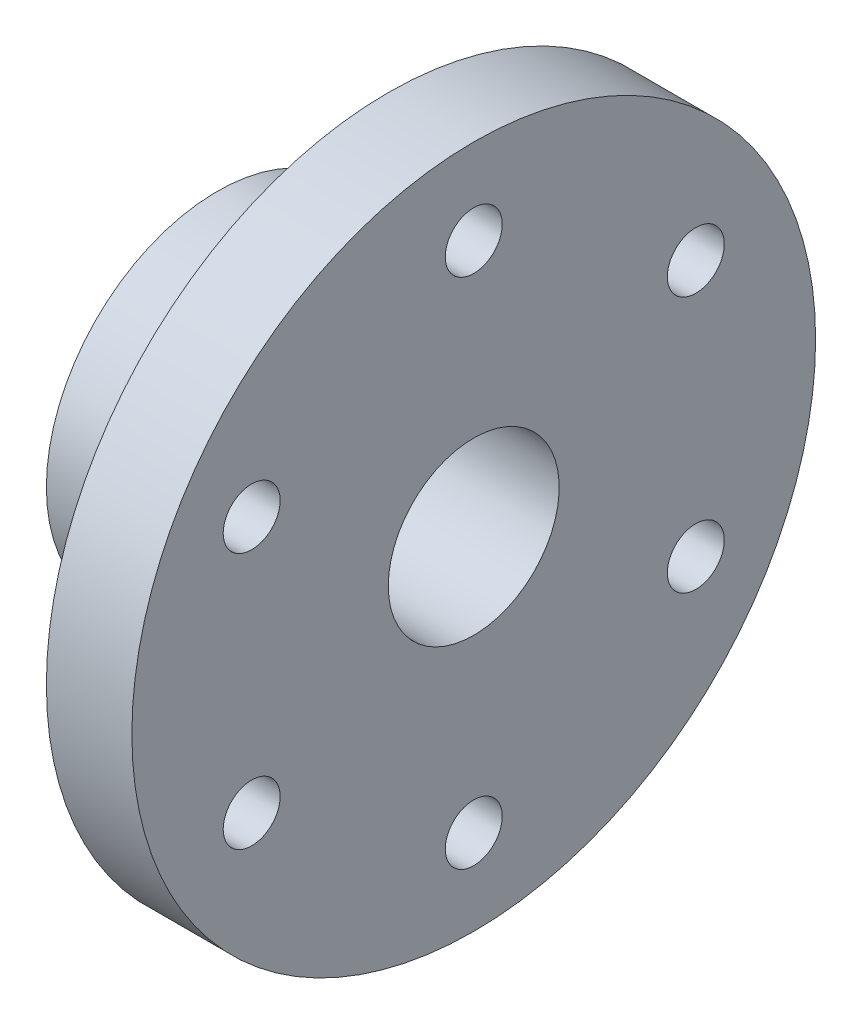
ISO-10303-21;
HEADER;
FILE_DESCRIPTION(('STEP AP214'),'2;1');
FILE_NAME('part.step','',(''),(''),'','','');
FILE_SCHEMA(('AUTOMOTIVE_DESIGN { 1 0 10303 214 1 1 1 1 }'));
ENDSEC;
DATA;
#1=APPLICATION_CONTEXT('core data for automotive mechanical design processes');
#2=APPLICATION_PROTOCOL_DEFINITION('international standard','automotive_design',2000,#1);
#3=PRODUCT_CONTEXT('',#1,'mechanical');
#4=PRODUCT('Part','Part','',(#3));
#5=PRODUCT_RELATED_PRODUCT_CATEGORY('part','',(#4));
#6=PRODUCT_DEFINITION_FORMATION('','',#4);
#7=PRODUCT_DEFINITION_CONTEXT('part definition',#1,'design');
#8=PRODUCT_DEFINITION('design','',#6,#7);
#9=PRODUCT_DEFINITION_SHAPE('','',#8);
#10=(LENGTH_UNIT() NAMED_UNIT(*) SI_UNIT(.MILLI.,.METRE.));
#11=(NAMED_UNIT(*) PLANE_ANGLE_UNIT() SI_UNIT($,.RADIAN.));
#12=(NAMED_UNIT(*) SI_UNIT($,.STERADIAN.) SOLID_ANGLE_UNIT());
#13=UNCERTAINTY_MEASURE_WITH_UNIT(LENGTH_MEASURE(1.E-05),#10,'distance_accuracy_value','');
#14=(GEOMETRIC_REPRESENTATION_CONTEXT(3) GLOBAL_UNCERTAINTY_ASSIGNED_CONTEXT((#13)) GLOBAL_UNIT_ASSIGNED_CONTEXT((#10,
#11,#12)) REPRESENTATION_CONTEXT('',''));
#15=CARTESIAN_POINT('',(0.,0.,0.));
#16=DIRECTION('',(0.,0.,1.));
#17=DIRECTION('',(1.,0.,0.));
#18=AXIS2_PLACEMENT_3D('',#15,#16,#17);
#19=CARTESIAN_POINT('',(-11.6129032258065,0.,0.));
#20=DIRECTION('',(-1.,0.,0.));
#21=DIRECTION('',(0.,0.,1.));
#22=AXIS2_PLACEMENT_3D('',#19,#20,#21);
#23=CYLINDRICAL_SURFACE('',#22,24.);
#24=CARTESIAN_POINT('',(-9.70046082949309,0.,24.));
#25=CARTESIAN_POINT('',(-9.7004697718096,-0.223025447933144,23.9999961787012));
#26=CARTESIAN_POINT('',(-9.71917646944337,-0.446172610942113,23.9968588466085));
#27=CARTESIAN_POINT('',(-9.79347788351762,-0.886208354676868,23.9846455190622));
#28=CARTESIAN_POINT('',(-9.84910652055166,-1.1030909887348,23.9755640627822));
#29=CARTESIAN_POINT('',(-9.9955255472415,-1.52416759554023,23.9524810917832));
#30=CARTESIAN_POINT('',(-10.086287174518,-1.72837178949104,23.9384836025471));
#31=CARTESIAN_POINT('',(-10.3003204967769,-2.11862694716471,23.9071076333131));
#32=CARTESIAN_POINT('',(-10.4235884734659,-2.30467998380575,23.8897295400709));
#33=CARTESIAN_POINT('',(-10.7003889636058,-2.65515618286669,23.853333079333));
#34=CARTESIAN_POINT('',(-10.8541714129109,-2.81938064565595,23.8343019490377));
#35=CARTESIAN_POINT('',(-11.1870975790496,-3.11982159785588,23.7968420300277));
#36=CARTESIAN_POINT('',(-11.3662428958237,-3.25603631902555,23.7784132794027));
#37=CARTESIAN_POINT('',(-11.7461743754084,-3.49738740096821,23.7441210521565));
#38=CARTESIAN_POINT('',(-11.9470869683807,-3.6023272845776,23.7282740654662));
#39=CARTESIAN_POINT('',(-12.3639961323741,-3.77689338465795,23.7011166367148));
#40=CARTESIAN_POINT('',(-12.5799916833773,-3.84652198650498,23.6898058882289));
#41=CARTESIAN_POINT('',(-13.0188292692636,-3.94786300445569,23.6731285894841));
#42=CARTESIAN_POINT('',(-13.2415900078953,-3.97991844661664,23.6677082957712));
#43=CARTESIAN_POINT('',(-13.6893892725066,-4.0062667604638,23.6632630229864));
#44=CARTESIAN_POINT('',(-13.9144276361608,-4.0005623046224,23.6642375913154));
#45=CARTESIAN_POINT('',(-14.3579454075338,-3.95183215743384,23.6724228618169));
#46=CARTESIAN_POINT('',(-14.5764685151655,-3.90919181102364,23.6795691731027));
#47=CARTESIAN_POINT('',(-15.0032149380197,-3.78840502464551,23.6991919233761));
#48=CARTESIAN_POINT('',(-15.2114378997148,-3.71025736691159,23.7116685451723));
#49=CARTESIAN_POINT('',(-15.6128269469986,-3.52028359375026,23.7406156693456));
#50=CARTESIAN_POINT('',(-15.8059158792231,-3.40829746220754,23.7571050737172));
#51=CARTESIAN_POINT('',(-16.1707078703545,-3.1539392280919,23.7922066946401));
#52=CARTESIAN_POINT('',(-16.342409201421,-3.01156467304686,23.8108190824686));
#53=CARTESIAN_POINT('',(-16.6617825667848,-2.69837153945449,23.8483524460766));
#54=CARTESIAN_POINT('',(-16.8091304591572,-2.527222342197,23.8672743877064));
#55=CARTESIAN_POINT('',(-17.0730652497576,-2.16245639837063,23.9030816223476));
#56=CARTESIAN_POINT('',(-17.1896519497863,-1.96883950705028,23.9199669022359));
#57=CARTESIAN_POINT('',(-17.3887843929111,-1.56432946586674,23.9498222862866));
#58=CARTESIAN_POINT('',(-17.4713015004231,-1.35342196090346,23.9627890945191));
#59=CARTESIAN_POINT('',(-17.5996515738867,-0.92047735296437,23.9833200482025));
#60=CARTESIAN_POINT('',(-17.645487608651,-0.69844118268715,23.9908846456076));
#61=CARTESIAN_POINT('',(-17.6987350030309,-0.252335842082599,23.999698077483));
#62=CARTESIAN_POINT('',(-17.7065913443821,-0.028321179441619,24.0010200482045));
#63=CARTESIAN_POINT('',(-17.6848426784081,0.417823636623819,23.9973995907387));
#64=CARTESIAN_POINT('',(-17.6552391124791,0.639953862227262,23.9924574035859));
#65=CARTESIAN_POINT('',(-17.5597810705563,1.07464988087482,23.9769092310112));
#66=CARTESIAN_POINT('',(-17.4941468960689,1.28726538941661,23.966337676821));
#67=CARTESIAN_POINT('',(-17.3287256003738,1.69847501577671,23.9407114312857));
#68=CARTESIAN_POINT('',(-17.2289365612767,1.89706834545555,23.9256564881923));
#69=CARTESIAN_POINT('',(-16.9970190299782,2.27652910315033,23.8925522608385));
#70=CARTESIAN_POINT('',(-16.8646125796255,2.45722440149944,23.8744776941924));
#71=CARTESIAN_POINT('',(-16.571601124877,2.7939897368043,23.8374154782704));
#72=CARTESIAN_POINT('',(-16.4109940722504,2.95005798351453,23.8184277627447));
#73=CARTESIAN_POINT('',(-16.0641447525788,3.2347884474528,23.7814428037735));
#74=CARTESIAN_POINT('',(-15.87765416467,3.36315001778194,23.7634578581937));
#75=CARTESIAN_POINT('',(-15.4854960788714,3.58672369647198,23.7307444764461));
#76=CARTESIAN_POINT('',(-15.2798291891291,3.68193685563172,23.7160159370563));
#77=CARTESIAN_POINT('',(-14.8559972569937,3.83606133035704,23.6915752591633));
#78=CARTESIAN_POINT('',(-14.6378878774443,3.89512229207671,23.681842468977));
#79=CARTESIAN_POINT('',(-14.1946686227383,3.97573672604524,23.6684434693642));
#80=CARTESIAN_POINT('',(-13.9695593579218,3.99729345911387,23.6647767325235));
#81=CARTESIAN_POINT('',(-13.5217325639532,4.00219658567577,23.6639477293442));
#82=CARTESIAN_POINT('',(-13.2990202237726,3.9860162178003,23.6667049040904));
#83=CARTESIAN_POINT('',(-12.8595340326119,3.91692774233096,23.6782365032596));
#84=CARTESIAN_POINT('',(-12.6427601623861,3.86401975377996,23.6870109081794));
#85=CARTESIAN_POINT('',(-12.2214873298249,3.72315918335184,23.7095577005075));
#86=CARTESIAN_POINT('',(-12.0169744134035,3.63524734496071,23.7233242755147));
#87=CARTESIAN_POINT('',(-11.6255237587813,3.42692320626545,23.7543099027553));
#88=CARTESIAN_POINT('',(-11.4385868928977,3.3065092939977,23.7715291262144));
#89=CARTESIAN_POINT('',(-11.0852038965207,3.03491021499545,23.8077352647299));
#90=CARTESIAN_POINT('',(-10.9190272027727,2.88337690174984,23.8267407292208));
#91=CARTESIAN_POINT('',(-10.6142982623332,2.55457445020837,23.8642299577735));
#92=CARTESIAN_POINT('',(-10.475752399672,2.37729938066022,23.8827136004247));
#93=CARTESIAN_POINT('',(-10.2293436003732,2.00059067142445,23.9172244742755));
#94=CARTESIAN_POINT('',(-10.1216991665924,1.80101246005251,23.9332338600497));
#95=CARTESIAN_POINT('',(-9.94162965411722,1.38642091100637,23.9608186816284));
#96=CARTESIAN_POINT('',(-9.86916949976558,1.17142319172802,23.9723985308397));
#97=CARTESIAN_POINT('',(-9.77725239089043,0.796325296072642,23.9872926533273));
#98=CARTESIAN_POINT('',(-9.74850167810755,0.638494128477517,23.9920324363737));
#99=CARTESIAN_POINT('',(-9.71010284894149,0.320462896511695,23.9983874557779));
#100=CARTESIAN_POINT('',(-9.70045440367331,0.160262872973591,24.0000027459303));
#101=CARTESIAN_POINT('',(-9.70046082949309,0.,24.));
#102=B_SPLINE_CURVE_WITH_KNOTS('',3,(#24,#25,#26,#27,#28,#29,#30,#31,#32,#33,#34,#35,#36,#37,
#38,#39,#40,#41,#42,#43,#44,#45,#46,#47,#48,#49,#50,#51,#52,#53,#54,#55,#56,#57,#58,#59,#60,#61,
#62,#63,#64,#65,#66,#67,#68,#69,#70,#71,#72,#73,#74,#75,#76,#77,#78,#79,#80,#81,#82,#83,#84,#85,
#86,#87,#88,#89,#90,#91,#92,#93,#94,#95,#96,#97,#98,#99,#100,#101),.UNSPECIFIED.,.T.,.F.,(4,2,2,
2,2,2,2,2,2,2,2,2,2,2,2,2,2,2,2,2,2,2,2,2,2,2,2,2,2,2,2,2,2,2,2,2,2,2,4),(0.,0.668490535901615,
1.33759607311267,2.00615498724043,2.67463746027966,3.34883985699731,4.02308480271771,
4.70148033318144,5.3798300300189,6.05193723365478,6.72399686913418,7.38912834816654,
8.0542826404061,8.72263290612092,9.39103713088918,10.0677243185812,10.7444158661736,
11.4216750226545,12.0988775123384,12.7681261358624,13.4373490085738,14.1025249121026,
14.7677381732171,15.4388292100324,16.1099690088685,16.7880611521219,17.4661317980151,
18.1413763574684,18.8165622045859,19.4833265523632,20.1500887390101,20.8160770916196,
21.4820984804694,22.1560221470943,22.8301013420636,23.5088357057152,24.1868920340812,
24.6672679706243,25.1476356364315),.UNSPECIFIED.);
#103=CARTESIAN_POINT('',(-9.70046082949309,0.,24.));
#104=VERTEX_POINT('',#103);
#105=EDGE_CURVE('E91',#104,#104,#102,.T.);
#106=ORIENTED_EDGE('',*,*,#105,.T.);
#107=EDGE_LOOP('',(#106));
#108=FACE_BOUND('',#107,.T.);
#109=CARTESIAN_POINT('',(-25.7004608294931,0.,0.));
#110=DIRECTION('',(-1.,0.,0.));
#111=DIRECTION('',(0.,0.,1.));
#112=AXIS2_PLACEMENT_3D('',#109,#110,#111);
#113=CIRCLE('',#112,24.);
#114=CARTESIAN_POINT('',(-25.7004608294931,0.,24.));
#115=VERTEX_POINT('',#114);
#116=EDGE_CURVE('E10',#115,#115,#113,.T.);
#117=ORIENTED_EDGE('',*,*,#116,.F.);
#118=EDGE_LOOP('',(#117));
#119=FACE_BOUND('',#118,.T.);
#120=CARTESIAN_POINT('',(-1.70046082949309,0.,0.));
#121=DIRECTION('',(-1.,0.,0.));
#122=DIRECTION('',(0.,0.,1.));
#123=AXIS2_PLACEMENT_3D('',#120,#121,#122);
#124=CIRCLE('',#123,24.);
#125=CARTESIAN_POINT('',(-1.70046082949309,0.,24.));
#126=VERTEX_POINT('',#125);
#127=EDGE_CURVE('E56',#126,#126,#124,.T.);
#128=ORIENTED_EDGE('',*,*,#127,.T.);
#129=EDGE_LOOP('',(#128));
#130=FACE_BOUND('',#129,.T.);
#131=ADVANCED_FACE('F33',(#108,#119,#130),#23,.T.);
#132=CARTESIAN_POINT('',(-25.7004608294931,12.,0.));
#133=DIRECTION('',(1.,0.,0.));
#134=DIRECTION('',(0.,0.,-1.));
#135=AXIS2_PLACEMENT_3D('',#132,#133,#134);
#136=PLANE('',#135);
#137=CARTESIAN_POINT('',(-25.7004608294931,0.,0.));
#138=DIRECTION('',(-1.,0.,0.));
#139=DIRECTION('',(0.,0.,1.));
#140=AXIS2_PLACEMENT_3D('',#137,#138,#139);
#141=CIRCLE('',#140,12.);
#142=CARTESIAN_POINT('',(-25.7004608294931,0.,12.));
#143=VERTEX_POINT('',#142);
#144=EDGE_CURVE('E40',#143,#143,#141,.T.);
#145=ORIENTED_EDGE('',*,*,#144,.F.);
#146=EDGE_LOOP('',(#145));
#147=FACE_BOUND('',#146,.T.);
#148=ORIENTED_EDGE('',*,*,#116,.T.);
#149=EDGE_LOOP('',(#148));
#150=FACE_BOUND('',#149,.T.);
#151=ADVANCED_FACE('F152',(#147,#150),#136,.F.);
#152=CARTESIAN_POINT('',(-11.6129032258065,0.,0.));
#153=DIRECTION('',(-1.,0.,0.));
#154=DIRECTION('',(0.,0.,1.));
#155=AXIS2_PLACEMENT_3D('',#152,#153,#154);
#156=CYLINDRICAL_SURFACE('',#155,12.);
#157=CARTESIAN_POINT('',(-9.70046082949309,0.,12.));
#158=CARTESIAN_POINT('',(-9.70045981456653,-0.218253451546893,12.0000006120378));
#159=CARTESIAN_POINT('',(-9.71838189400196,-0.4365007781542,11.9939907803018));
#160=CARTESIAN_POINT('',(-9.78937726476197,-0.866567043491889,11.9706084081312));
#161=CARTESIAN_POINT('',(-9.84245420528878,-1.07838531247527,11.9532346880861));
#162=CARTESIAN_POINT('',(-9.98173780302929,-1.4893311580071,11.9090123162577));
#163=CARTESIAN_POINT('',(-10.0678890793302,-1.68847930354414,11.8821795092341));
#164=CARTESIAN_POINT('',(-10.2706255208465,-2.0694997472213,11.8217778286937));
#165=CARTESIAN_POINT('',(-10.3872166895035,-2.25136862783483,11.7882076267112));
#166=CARTESIAN_POINT('',(-10.6517640489281,-2.59896670008906,11.7165637777201));
#167=CARTESIAN_POINT('',(-10.8005857665351,-2.76401480119322,11.6783822585509));
#168=CARTESIAN_POINT('',(-11.1235294483193,-3.06733077080835,11.6024125913253));
#169=CARTESIAN_POINT('',(-11.297656969207,-3.20559274195791,11.5646245316238));
#170=CARTESIAN_POINT('',(-11.6724012902791,-3.45529976891137,11.492533299089));
#171=CARTESIAN_POINT('',(-11.873635788422,-3.5658594328839,11.4583615710204));
#172=CARTESIAN_POINT('',(-12.2931652073268,-3.75127549551112,11.3990122167512));
#173=CARTESIAN_POINT('',(-12.5114548981424,-3.82614278954793,11.3738318464566));
#174=CARTESIAN_POINT('',(-12.9511537154816,-3.93549384603581,11.3364521307492));
#175=CARTESIAN_POINT('',(-13.1722096634554,-3.97125379308399,11.3238438306895));
#176=CARTESIAN_POINT('',(-13.6175158461106,-4.005364493341,11.3118262652752));
#177=CARTESIAN_POINT('',(-13.8417650723073,-4.0037268064304,11.312412921263));
#178=CARTESIAN_POINT('',(-14.2762073513007,-3.96407961480178,11.3263605999899));
#179=CARTESIAN_POINT('',(-14.4865744412676,-3.92773565262441,11.3391366334693));
#180=CARTESIAN_POINT('',(-14.8980345080139,-3.82242465135522,11.3750663077523));
#181=CARTESIAN_POINT('',(-15.099126371255,-3.75345370635799,11.3982211910317));
#182=CARTESIAN_POINT('',(-15.4901118278288,-3.58375623225407,11.4527164455867));
#183=CARTESIAN_POINT('',(-15.6797729313631,-3.4825361948326,11.4841826318151));
#184=CARTESIAN_POINT('',(-16.0399444626201,-3.25155642520901,11.5517023429386));
#185=CARTESIAN_POINT('',(-16.2104493372288,-3.12178844945505,11.5877571915937));
#186=CARTESIAN_POINT('',(-16.5368272221338,-2.82939733072998,11.6626931667357));
#187=CARTESIAN_POINT('',(-16.6914716075287,-2.66541260030552,11.7016235742007));
#188=CARTESIAN_POINT('',(-16.9713858961473,-2.31335827987998,11.7762775354745));
#189=CARTESIAN_POINT('',(-17.0966529821512,-2.12528638264318,11.8120007815208));
#190=CARTESIAN_POINT('',(-17.3152460304332,-1.72779045218514,11.8766843175136));
#191=CARTESIAN_POINT('',(-17.408242794856,-1.51817310566536,11.9055740003221));
#192=CARTESIAN_POINT('',(-17.557273525316,-1.08507633345801,11.9528226857769));
#193=CARTESIAN_POINT('',(-17.6133203311869,-0.861601752619807,11.971185346195));
#194=CARTESIAN_POINT('',(-17.6846834935825,-0.417535318117219,11.9947050828577));
#195=CARTESIAN_POINT('',(-17.7016600661841,-0.197238399459384,12.0004000733492));
#196=CARTESIAN_POINT('',(-17.6991301350992,0.243100279840953,11.9995561077931));
#197=CARTESIAN_POINT('',(-17.6796297895736,0.463142077278604,11.9930192167745));
#198=CARTESIAN_POINT('',(-17.6060131985493,0.890079465217023,11.9688009886842));
#199=CARTESIAN_POINT('',(-17.5529160052951,1.09717122733937,11.9514479484477));
#200=CARTESIAN_POINT('',(-17.4148870516262,1.4994238343183,11.9076738732028));
#201=CARTESIAN_POINT('',(-17.329951231622,1.69458315403443,11.881251681867));
#202=CARTESIAN_POINT('',(-17.12817910213,2.0731531855731,11.8211572514916));
#203=CARTESIAN_POINT('',(-17.0105624563604,2.25611983686859,11.7873125902314));
#204=CARTESIAN_POINT('',(-16.7476842294392,2.60025932054235,11.7162101566505));
#205=CARTESIAN_POINT('',(-16.602414205366,2.76142547118231,11.6789513437531));
#206=CARTESIAN_POINT('',(-16.2805458254667,3.0650100312252,11.6030739192178));
#207=CARTESIAN_POINT('',(-16.1028239217856,3.20624387698309,11.5644704434971));
#208=CARTESIAN_POINT('',(-15.7253745582495,3.4570300892943,11.4919989317883));
#209=CARTESIAN_POINT('',(-15.5256469149568,3.56658219172405,11.4581309352801));
#210=CARTESIAN_POINT('',(-15.1097687683335,3.75038772166545,11.3992956716553));
#211=CARTESIAN_POINT('',(-14.893652512818,3.82471252866008,11.3743104317191));
#212=CARTESIAN_POINT('',(-14.4509462293166,3.93557866703742,11.336433292258));
#213=CARTESIAN_POINT('',(-14.2243609678757,3.97213701981576,11.3235359449456));
#214=CARTESIAN_POINT('',(-13.7796724453294,4.00510512990937,11.3119143549671));
#215=CARTESIAN_POINT('',(-13.5617314683458,4.0034810292336,11.3124960102966));
#216=CARTESIAN_POINT('',(-13.1294005298048,3.96496917379477,11.3260507929547));
#217=CARTESIAN_POINT('',(-12.9150103576727,3.92808351783434,11.3390231827745));
#218=CARTESIAN_POINT('',(-12.4999181774832,3.82148725251738,11.3753809721957));
#219=CARTESIAN_POINT('',(-12.2990335294751,3.75241338406206,11.3985639208991));
#220=CARTESIAN_POINT('',(-11.91155120174,3.58391746303899,11.4526559527387));
#221=CARTESIAN_POINT('',(-11.7249567047411,3.48448867421522,11.4835667505357));
#222=CARTESIAN_POINT('',(-11.3625261498014,3.25304277033372,11.5513131690418));
#223=CARTESIAN_POINT('',(-11.1875148218995,3.11979297105832,11.5883484656855));
#224=CARTESIAN_POINT('',(-10.8617015759563,2.82657153254259,11.6633342513301));
#225=CARTESIAN_POINT('',(-10.7109065267408,2.66659233780593,11.7012849964949));
#226=CARTESIAN_POINT('',(-10.4318831803364,2.31696622768275,11.7756012210218));
#227=CARTESIAN_POINT('',(-10.3047634384891,2.12640605399891,11.8118472720503));
#228=CARTESIAN_POINT('',(-10.0844991140905,1.7254294296265,11.8770396469045));
#229=CARTESIAN_POINT('',(-9.99134584580493,1.51501807252939,11.9059878363172));
#230=CARTESIAN_POINT('',(-9.84557429953841,1.0899745888039,11.9522206027417));
#231=CARTESIAN_POINT('',(-9.79133096443959,0.875951030705635,11.9699684969009));
#232=CARTESIAN_POINT('',(-9.71877970678459,0.441281664040989,11.9938562825689));
#233=CARTESIAN_POINT('',(-9.70046185550695,0.220637702274986,11.9999993812762));
#234=CARTESIAN_POINT('',(-9.70046082949309,0.,12.));
#235=B_SPLINE_CURVE_WITH_KNOTS('',3,(#157,#158,#159,#160,#161,#162,#163,#164,#165,#166,#167,
#168,#169,#170,#171,#172,#173,#174,#175,#176,#177,#178,#179,#180,#181,#182,#183,#184,#185,#186,
#187,#188,#189,#190,#191,#192,#193,#194,#195,#196,#197,#198,#199,#200,#201,#202,#203,#204,#205,
#206,#207,#208,#209,#210,#211,#212,#213,#214,#215,#216,#217,#218,#219,#220,#221,#222,#223,#224,
#225,#226,#227,#228,#229,#230,#231,#232,#233,#234),.UNSPECIFIED.,.T.,.F.,(4,2,2,2,2,2,2,2,2,2,2,
2,2,2,2,2,2,2,2,2,2,2,2,2,2,2,2,2,2,2,2,2,2,2,2,2,2,2,4),(0.,0.653948424104044,1.30796474107008,
1.9608906914811,2.6139455111964,3.28738737131024,3.96097733150121,4.65393539293882,
5.34668178771334,6.01607702967361,6.68526535949942,7.32387306208104,7.96255723427582,
8.61152684626176,9.26068410238483,9.94373223251122,10.6268458387213,11.3167362260708,
12.0063867551449,12.6661433270633,13.3257885266236,13.9663263191851,14.6069458114207,
15.264415993806,15.9220872329322,16.6096409152866,17.2972003294564,17.9833605531274,
18.6692113882901,19.3198266426269,19.9704031741115,20.6086234832732,21.2469855270956,
21.9132026677287,22.5796084450077,23.2719864334606,23.9641872461548,24.6254623350091,
25.2865546415821),.UNSPECIFIED.);
#236=CARTESIAN_POINT('',(-9.70046082949309,0.,12.));
#237=VERTEX_POINT('',#236);
#238=EDGE_CURVE('E102',#237,#237,#235,.T.);
#239=ORIENTED_EDGE('',*,*,#238,.F.);
#240=EDGE_LOOP('',(#239));
#241=FACE_BOUND('',#240,.T.);
#242=CARTESIAN_POINT('',(10.2995391705069,0.,0.));
#243=DIRECTION('',(-1.,0.,0.));
#244=DIRECTION('',(0.,0.,1.));
#245=AXIS2_PLACEMENT_3D('',#242,#243,#244);
#246=CIRCLE('',#245,12.);
#247=CARTESIAN_POINT('',(10.2995391705069,0.,12.));
#248=VERTEX_POINT('',#247);
#249=EDGE_CURVE('E44',#248,#248,#246,.T.);
#250=ORIENTED_EDGE('',*,*,#249,.F.);
#251=EDGE_LOOP('',(#250));
#252=FACE_BOUND('',#251,.T.);
#253=ORIENTED_EDGE('',*,*,#144,.T.);
#254=EDGE_LOOP('',(#253));
#255=FACE_BOUND('',#254,.T.);
#256=ADVANCED_FACE('F149',(#241,#252,#255),#156,.F.);
#257=CARTESIAN_POINT('',(10.2995391705069,48.,0.));
#258=DIRECTION('',(-1.,0.,0.));
#259=DIRECTION('',(0.,0.,1.));
#260=AXIS2_PLACEMENT_3D('',#257,#258,#259);
#261=PLANE('',#260);
#262=CARTESIAN_POINT('',(10.2995391705069,36.,0.));
#263=DIRECTION('',(-1.,0.,0.));
#264=DIRECTION('',(0.,0.,1.));
#265=AXIS2_PLACEMENT_3D('',#262,#263,#264);
#266=CIRCLE('',#265,4.);
#267=CARTESIAN_POINT('',(10.2995391705069,36.,4.));
#268=VERTEX_POINT('',#267);
#269=EDGE_CURVE('E59',#268,#268,#266,.F.);
#270=ORIENTED_EDGE('',*,*,#269,.F.);
#271=EDGE_LOOP('',(#270));
#272=FACE_BOUND('',#271,.T.);
#273=CARTESIAN_POINT('',(10.2995391705069,17.9999999999991,-31.1769145362393));
#274=DIRECTION('',(-1.,0.,0.));
#275=DIRECTION('',(0.,0.,1.));
#276=AXIS2_PLACEMENT_3D('',#273,#274,#275);
#277=CIRCLE('',#276,4.);
#278=CARTESIAN_POINT('',(10.2995391705069,17.9999999999991,-27.1769145362393));
#279=VERTEX_POINT('',#278);
#280=EDGE_CURVE('E67',#279,#279,#277,.F.);
#281=ORIENTED_EDGE('',*,*,#280,.F.);
#282=EDGE_LOOP('',(#281));
#283=FACE_BOUND('',#282,.T.);
#284=CARTESIAN_POINT('',(10.2995391705069,-18.0000000000009,-31.1769145362383));
#285=DIRECTION('',(-1.,0.,0.));
#286=DIRECTION('',(0.,0.,1.));
#287=AXIS2_PLACEMENT_3D('',#284,#285,#286);
#288=CIRCLE('',#287,4.);
#289=CARTESIAN_POINT('',(10.2995391705069,-18.0000000000009,-27.1769145362383));
#290=VERTEX_POINT('',#289);
#291=EDGE_CURVE('E60',#290,#290,#288,.F.);
#292=ORIENTED_EDGE('',*,*,#291,.F.);
#293=EDGE_LOOP('',(#292));
#294=FACE_BOUND('',#293,.T.);
#295=CARTESIAN_POINT('',(10.2995391705069,-36.,1.95916913198922E-12));
#296=DIRECTION('',(-1.,0.,0.));
#297=DIRECTION('',(0.,0.,1.));
#298=AXIS2_PLACEMENT_3D('',#295,#296,#297);
#299=CIRCLE('',#298,4.);
#300=CARTESIAN_POINT('',(10.2995391705069,-36.,4.00000000000196));
#301=VERTEX_POINT('',#300);
#302=EDGE_CURVE('E68',#301,#301,#299,.F.);
#303=ORIENTED_EDGE('',*,*,#302,.F.);
#304=EDGE_LOOP('',(#303));
#305=FACE_BOUND('',#304,.T.);
#306=CARTESIAN_POINT('',(10.2995391705069,-17.9999999999991,31.1769145362413));
#307=DIRECTION('',(-1.,0.,0.));
#308=DIRECTION('',(0.,0.,1.));
#309=AXIS2_PLACEMENT_3D('',#306,#307,#308);
#310=CIRCLE('',#309,4.00000000000001);
#311=CARTESIAN_POINT('',(10.2995391705069,-17.9999999999991,35.1769145362413));
#312=VERTEX_POINT('',#311);
#313=EDGE_CURVE('E74',#312,#312,#310,.F.);
#314=ORIENTED_EDGE('',*,*,#313,.F.);
#315=EDGE_LOOP('',(#314));
#316=FACE_BOUND('',#315,.T.);
#317=CARTESIAN_POINT('',(10.2995391705069,18.0000000000009,31.1769145362403));
#318=DIRECTION('',(-1.,0.,0.));
#319=DIRECTION('',(0.,0.,1.));
#320=AXIS2_PLACEMENT_3D('',#317,#318,#319);
#321=CIRCLE('',#320,4.00000000000001);
#322=CARTESIAN_POINT('',(10.2995391705069,18.0000000000009,35.1769145362403));
#323=VERTEX_POINT('',#322);
#324=EDGE_CURVE('E80',#323,#323,#321,.F.);
#325=ORIENTED_EDGE('',*,*,#324,.F.);
#326=EDGE_LOOP('',(#325));
#327=FACE_BOUND('',#326,.T.);
#328=CARTESIAN_POINT('',(10.2995391705069,0.,0.));
#329=DIRECTION('',(-1.,0.,0.));
#330=DIRECTION('',(0.,0.,1.));
#331=AXIS2_PLACEMENT_3D('',#328,#329,#330);
#332=CIRCLE('',#331,48.);
#333=CARTESIAN_POINT('',(10.2995391705069,0.,48.));
#334=VERTEX_POINT('',#333);
#335=EDGE_CURVE('E48',#334,#334,#332,.T.);
#336=ORIENTED_EDGE('',*,*,#335,.F.);
#337=EDGE_LOOP('',(#336));
#338=FACE_BOUND('',#337,.T.);
#339=ORIENTED_EDGE('',*,*,#249,.T.);
#340=EDGE_LOOP('',(#339));
#341=FACE_BOUND('',#340,.T.);
#342=ADVANCED_FACE('F145',(#272,#283,#294,#305,#316,#327,#338,#341),#261,.F.);
#343=CARTESIAN_POINT('',(-11.6129032258065,0.,0.));
#344=DIRECTION('',(-1.,0.,0.));
#345=DIRECTION('',(0.,0.,1.));
#346=AXIS2_PLACEMENT_3D('',#343,#344,#345);
#347=CYLINDRICAL_SURFACE('',#346,48.);
#348=CARTESIAN_POINT('',(-1.70046082949309,0.,0.));
#349=DIRECTION('',(-1.,0.,0.));
#350=DIRECTION('',(0.,0.,1.));
#351=AXIS2_PLACEMENT_3D('',#348,#349,#350);
#352=CIRCLE('',#351,48.);
#353=CARTESIAN_POINT('',(-1.70046082949309,0.,48.));
#354=VERTEX_POINT('',#353);
#355=EDGE_CURVE('E53',#354,#354,#352,.T.);
#356=ORIENTED_EDGE('',*,*,#355,.F.);
#357=EDGE_LOOP('',(#356));
#358=FACE_BOUND('',#357,.T.);
#359=ORIENTED_EDGE('',*,*,#335,.T.);
#360=EDGE_LOOP('',(#359));
#361=FACE_BOUND('',#360,.T.);
#362=ADVANCED_FACE('F141',(#358,#361),#347,.T.);
#363=CARTESIAN_POINT('',(-1.70046082949309,24.,0.));
#364=DIRECTION('',(1.,0.,0.));
#365=DIRECTION('',(0.,0.,-1.));
#366=AXIS2_PLACEMENT_3D('',#363,#364,#365);
#367=PLANE('',#366);
#368=CARTESIAN_POINT('',(-1.70046082949309,36.,0.));
#369=DIRECTION('',(-1.,0.,0.));
#370=DIRECTION('',(0.,0.,1.));
#371=AXIS2_PLACEMENT_3D('',#368,#369,#370);
#372=CIRCLE('',#371,4.);
#373=CARTESIAN_POINT('',(-1.70046082949309,36.,4.));
#374=VERTEX_POINT('',#373);
#375=EDGE_CURVE('E83',#374,#374,#372,.T.);
#376=ORIENTED_EDGE('',*,*,#375,.F.);
#377=EDGE_LOOP('',(#376));
#378=FACE_BOUND('',#377,.T.);
#379=CARTESIAN_POINT('',(-1.70046082949309,17.9999999999991,-31.1769145362393));
#380=DIRECTION('',(-1.,0.,0.));
#381=DIRECTION('',(0.,0.,1.));
#382=AXIS2_PLACEMENT_3D('',#379,#380,#381);
#383=CIRCLE('',#382,4.);
#384=CARTESIAN_POINT('',(-1.70046082949309,17.9999999999991,-27.1769145362393));
#385=VERTEX_POINT('',#384);
#386=EDGE_CURVE('E88',#385,#385,#383,.T.);
#387=ORIENTED_EDGE('',*,*,#386,.F.);
#388=EDGE_LOOP('',(#387));
#389=FACE_BOUND('',#388,.T.);
#390=CARTESIAN_POINT('',(-1.70046082949309,-18.0000000000009,-31.1769145362383));
#391=DIRECTION('',(-1.,0.,0.));
#392=DIRECTION('',(0.,0.,1.));
#393=AXIS2_PLACEMENT_3D('',#390,#391,#392);
#394=CIRCLE('',#393,4.);
#395=CARTESIAN_POINT('',(-1.70046082949309,-18.0000000000009,-27.1769145362383));
#396=VERTEX_POINT('',#395);
#397=EDGE_CURVE('E64',#396,#396,#394,.T.);
#398=ORIENTED_EDGE('',*,*,#397,.F.);
#399=EDGE_LOOP('',(#398));
#400=FACE_BOUND('',#399,.T.);
#401=CARTESIAN_POINT('',(-1.70046082949309,-36.,1.95916913198922E-12));
#402=DIRECTION('',(-1.,0.,0.));
#403=DIRECTION('',(0.,0.,1.));
#404=AXIS2_PLACEMENT_3D('',#401,#402,#403);
#405=CIRCLE('',#404,4.);
#406=CARTESIAN_POINT('',(-1.70046082949309,-36.,4.00000000000196));
#407=VERTEX_POINT('',#406);
#408=EDGE_CURVE('E63',#407,#407,#405,.T.);
#409=ORIENTED_EDGE('',*,*,#408,.F.);
#410=EDGE_LOOP('',(#409));
#411=FACE_BOUND('',#410,.T.);
#412=CARTESIAN_POINT('',(-1.70046082949309,-17.9999999999991,31.1769145362413));
#413=DIRECTION('',(-1.,0.,0.));
#414=DIRECTION('',(0.,0.,1.));
#415=AXIS2_PLACEMENT_3D('',#412,#413,#414);
#416=CIRCLE('',#415,4.00000000000001);
#417=CARTESIAN_POINT('',(-1.70046082949309,-17.9999999999991,35.1769145362413));
#418=VERTEX_POINT('',#417);
#419=EDGE_CURVE('E71',#418,#418,#416,.T.);
#420=ORIENTED_EDGE('',*,*,#419,.F.);
#421=EDGE_LOOP('',(#420));
#422=FACE_BOUND('',#421,.T.);
#423=CARTESIAN_POINT('',(-1.70046082949309,18.0000000000009,31.1769145362403));
#424=DIRECTION('',(-1.,0.,0.));
#425=DIRECTION('',(0.,0.,1.));
#426=AXIS2_PLACEMENT_3D('',#423,#424,#425);
#427=CIRCLE('',#426,4.00000000000001);
#428=CARTESIAN_POINT('',(-1.70046082949309,18.0000000000009,35.1769145362403));
#429=VERTEX_POINT('',#428);
#430=EDGE_CURVE('E77',#429,#429,#427,.T.);
#431=ORIENTED_EDGE('',*,*,#430,.F.);
#432=EDGE_LOOP('',(#431));
#433=FACE_BOUND('',#432,.T.);
#434=ORIENTED_EDGE('',*,*,#127,.F.);
#435=EDGE_LOOP('',(#434));
#436=FACE_BOUND('',#435,.T.);
#437=ORIENTED_EDGE('',*,*,#355,.T.);
#438=EDGE_LOOP('',(#437));
#439=FACE_BOUND('',#438,.T.);
#440=ADVANCED_FACE('F127',(#378,#389,#400,#411,#422,#433,#436,#439),#367,.F.);
#441=CARTESIAN_POINT('',(21.6132476694917,18.0000000000009,31.1769145362403));
#442=DIRECTION('',(-1.,0.,0.));
#443=DIRECTION('',(0.,0.,1.));
#444=AXIS2_PLACEMENT_3D('',#441,#442,#443);
#445=CYLINDRICAL_SURFACE('',#444,4.00000000000001);
#446=ORIENTED_EDGE('',*,*,#324,.T.);
#447=EDGE_LOOP('',(#446));
#448=FACE_BOUND('',#447,.T.);
#449=ORIENTED_EDGE('',*,*,#430,.T.);
#450=EDGE_LOOP('',(#449));
#451=FACE_BOUND('',#450,.T.);
#452=ADVANCED_FACE('F123',(#448,#451),#445,.F.);
#453=CARTESIAN_POINT('',(21.6132476694917,-17.9999999999991,31.1769145362413));
#454=DIRECTION('',(-1.,0.,0.));
#455=DIRECTION('',(0.,0.,1.));
#456=AXIS2_PLACEMENT_3D('',#453,#454,#455);
#457=CYLINDRICAL_SURFACE('',#456,4.00000000000001);
#458=ORIENTED_EDGE('',*,*,#313,.T.);
#459=EDGE_LOOP('',(#458));
#460=FACE_BOUND('',#459,.T.);
#461=ORIENTED_EDGE('',*,*,#419,.T.);
#462=EDGE_LOOP('',(#461));
#463=FACE_BOUND('',#462,.T.);
#464=ADVANCED_FACE('F126',(#460,#463),#457,.F.);
#465=CARTESIAN_POINT('',(21.6132476694917,-36.,1.95916913198922E-12));
#466=DIRECTION('',(-1.,0.,0.));
#467=DIRECTION('',(0.,0.,1.));
#468=AXIS2_PLACEMENT_3D('',#465,#466,#467);
#469=CYLINDRICAL_SURFACE('',#468,4.);
#470=ORIENTED_EDGE('',*,*,#302,.T.);
#471=EDGE_LOOP('',(#470));
#472=FACE_BOUND('',#471,.T.);
#473=ORIENTED_EDGE('',*,*,#408,.T.);
#474=EDGE_LOOP('',(#473));
#475=FACE_BOUND('',#474,.T.);
#476=ADVANCED_FACE('F131',(#472,#475),#469,.F.);
#477=CARTESIAN_POINT('',(21.6132476694917,-18.0000000000009,-31.1769145362383));
#478=DIRECTION('',(-1.,0.,0.));
#479=DIRECTION('',(0.,0.,1.));
#480=AXIS2_PLACEMENT_3D('',#477,#478,#479);
#481=CYLINDRICAL_SURFACE('',#480,4.);
#482=ORIENTED_EDGE('',*,*,#291,.T.);
#483=EDGE_LOOP('',(#482));
#484=FACE_BOUND('',#483,.T.);
#485=ORIENTED_EDGE('',*,*,#397,.T.);
#486=EDGE_LOOP('',(#485));
#487=FACE_BOUND('',#486,.T.);
#488=ADVANCED_FACE('F121',(#484,#487),#481,.F.);
#489=CARTESIAN_POINT('',(21.6132476694917,17.9999999999991,-31.1769145362393));
#490=DIRECTION('',(-1.,0.,0.));
#491=DIRECTION('',(0.,0.,1.));
#492=AXIS2_PLACEMENT_3D('',#489,#490,#491);
#493=CYLINDRICAL_SURFACE('',#492,4.);
#494=ORIENTED_EDGE('',*,*,#280,.T.);
#495=EDGE_LOOP('',(#494));
#496=FACE_BOUND('',#495,.T.);
#497=ORIENTED_EDGE('',*,*,#386,.T.);
#498=EDGE_LOOP('',(#497));
#499=FACE_BOUND('',#498,.T.);
#500=ADVANCED_FACE('F117',(#496,#499),#493,.F.);
#501=CARTESIAN_POINT('',(21.6132476694917,36.,0.));
#502=DIRECTION('',(-1.,0.,0.));
#503=DIRECTION('',(0.,0.,1.));
#504=AXIS2_PLACEMENT_3D('',#501,#502,#503);
#505=CYLINDRICAL_SURFACE('',#504,4.);
#506=ORIENTED_EDGE('',*,*,#269,.T.);
#507=EDGE_LOOP('',(#506));
#508=FACE_BOUND('',#507,.T.);
#509=ORIENTED_EDGE('',*,*,#375,.T.);
#510=EDGE_LOOP('',(#509));
#511=FACE_BOUND('',#510,.T.);
#512=ADVANCED_FACE('F111',(#508,#511),#505,.F.);
#513=CARTESIAN_POINT('',(-13.7004608294931,0.,-48.001));
#514=DIRECTION('',(0.,0.,1.));
#515=DIRECTION('',(1.,0.,0.));
#516=AXIS2_PLACEMENT_3D('',#513,#514,#515);
#517=CYLINDRICAL_SURFACE('',#516,4.);
#518=ORIENTED_EDGE('',*,*,#238,.T.);
#519=EDGE_LOOP('',(#518));
#520=FACE_BOUND('',#519,.T.);
#521=ORIENTED_EDGE('',*,*,#105,.F.);
#522=EDGE_LOOP('',(#521));
#523=FACE_BOUND('',#522,.T.);
#524=ADVANCED_FACE('F107',(#520,#523),#517,.F.);
#525=CLOSED_SHELL('',(#131,#151,#256,#342,#362,#440,#452,#464,#476,#488,#500,#512,#524));
#526=MANIFOLD_SOLID_BREP('B2',#525);
#527=ADVANCED_BREP_SHAPE_REPRESENTATION('',(#18,#526),#14);
#528=SHAPE_DEFINITION_REPRESENTATION(#9,#527);
ENDSEC;
END-ISO-10303-21;
